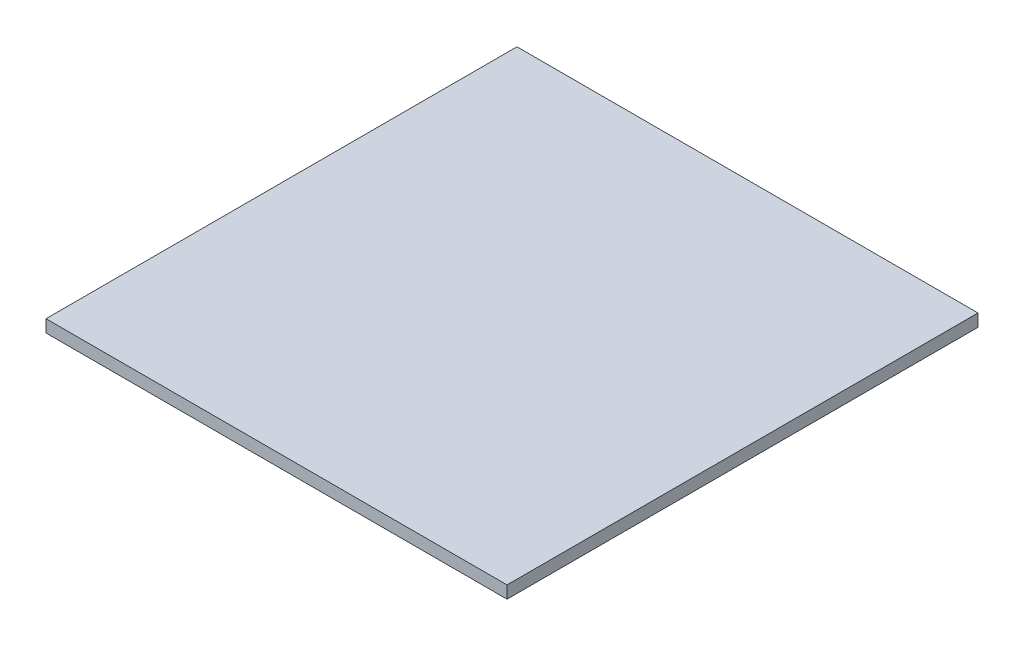
ISO-10303-21;
HEADER;
FILE_DESCRIPTION(('STEP AP214'),'2;1');
FILE_NAME('part.step','',(''),(''),'','','');
FILE_SCHEMA(('AUTOMOTIVE_DESIGN { 1 0 10303 214 1 1 1 1 }'));
ENDSEC;
DATA;
#1=APPLICATION_CONTEXT('core data for automotive mechanical design processes');
#2=APPLICATION_PROTOCOL_DEFINITION('international standard','automotive_design',2000,#1);
#3=PRODUCT_CONTEXT('',#1,'mechanical');
#4=PRODUCT('Part','Part','',(#3));
#5=PRODUCT_RELATED_PRODUCT_CATEGORY('part','',(#4));
#6=PRODUCT_DEFINITION_FORMATION('','',#4);
#7=PRODUCT_DEFINITION_CONTEXT('part definition',#1,'design');
#8=PRODUCT_DEFINITION('design','',#6,#7);
#9=PRODUCT_DEFINITION_SHAPE('','',#8);
#10=(LENGTH_UNIT() NAMED_UNIT(*) SI_UNIT(.MILLI.,.METRE.));
#11=(NAMED_UNIT(*) PLANE_ANGLE_UNIT() SI_UNIT($,.RADIAN.));
#12=(NAMED_UNIT(*) SI_UNIT($,.STERADIAN.) SOLID_ANGLE_UNIT());
#13=UNCERTAINTY_MEASURE_WITH_UNIT(LENGTH_MEASURE(1.E-05),#10,'distance_accuracy_value','');
#14=(GEOMETRIC_REPRESENTATION_CONTEXT(3) GLOBAL_UNCERTAINTY_ASSIGNED_CONTEXT((#13)) GLOBAL_UNIT_ASSIGNED_CONTEXT((#10,
#11,#12)) REPRESENTATION_CONTEXT('',''));
#15=CARTESIAN_POINT('',(0.,0.,0.));
#16=DIRECTION('',(0.,0.,1.));
#17=DIRECTION('',(1.,0.,0.));
#18=AXIS2_PLACEMENT_3D('',#15,#16,#17);
#19=CARTESIAN_POINT('',(0.,15.875,0.));
#20=DIRECTION('',(1.,0.,0.));
#21=DIRECTION('',(0.,0.,-1.));
#22=AXIS2_PLACEMENT_3D('',#19,#20,#21);
#23=PLANE('',#22);
#24=DIRECTION('',(0.,0.,1.));
#25=VECTOR('',#24,1.);
#26=CARTESIAN_POINT('',(0.,0.,0.));
#27=LINE('',#26,#25);
#28=CARTESIAN_POINT('',(0.,0.,-603.25));
#29=VERTEX_POINT('',#28);
#30=CARTESIAN_POINT('',(0.,0.,0.));
#31=VERTEX_POINT('',#30);
#32=EDGE_CURVE('E94',#29,#31,#27,.T.);
#33=ORIENTED_EDGE('',*,*,#32,.T.);
#34=DIRECTION('',(0.,-1.,0.));
#35=VECTOR('',#34,1.);
#36=CARTESIAN_POINT('',(0.,15.875,0.));
#37=LINE('',#36,#35);
#38=CARTESIAN_POINT('',(0.,15.875,0.));
#39=VERTEX_POINT('',#38);
#40=EDGE_CURVE('E11',#39,#31,#37,.T.);
#41=ORIENTED_EDGE('',*,*,#40,.F.);
#42=DIRECTION('',(0.,0.,1.));
#43=VECTOR('',#42,1.);
#44=CARTESIAN_POINT('',(0.,15.875,0.));
#45=LINE('',#44,#43);
#46=CARTESIAN_POINT('',(0.,15.875,-603.25));
#47=VERTEX_POINT('',#46);
#48=EDGE_CURVE('E82',#47,#39,#45,.T.);
#49=ORIENTED_EDGE('',*,*,#48,.F.);
#50=DIRECTION('',(0.,-1.,0.));
#51=VECTOR('',#50,1.);
#52=CARTESIAN_POINT('',(0.,15.875,-603.25));
#53=LINE('',#52,#51);
#54=EDGE_CURVE('E90',#47,#29,#53,.T.);
#55=ORIENTED_EDGE('',*,*,#54,.T.);
#56=EDGE_LOOP('',(#33,#41,#49,#55));
#57=FACE_BOUND('',#56,.T.);
#58=ADVANCED_FACE('F31',(#57),#23,.F.);
#59=CARTESIAN_POINT('',(0.,15.875,0.));
#60=DIRECTION('',(0.,0.,-1.));
#61=DIRECTION('',(-1.,0.,0.));
#62=AXIS2_PLACEMENT_3D('',#59,#60,#61);
#63=PLANE('',#62);
#64=DIRECTION('',(1.,0.,0.));
#65=VECTOR('',#64,1.);
#66=CARTESIAN_POINT('',(0.,0.,0.));
#67=LINE('',#66,#65);
#68=CARTESIAN_POINT('',(590.55,0.,0.));
#69=VERTEX_POINT('',#68);
#70=EDGE_CURVE('E86',#31,#69,#67,.T.);
#71=ORIENTED_EDGE('',*,*,#70,.T.);
#72=DIRECTION('',(0.,-1.,0.));
#73=VECTOR('',#72,1.);
#74=CARTESIAN_POINT('',(590.55,15.875,0.));
#75=LINE('',#74,#73);
#76=CARTESIAN_POINT('',(590.55,15.875,0.));
#77=VERTEX_POINT('',#76);
#78=EDGE_CURVE('E39',#77,#69,#75,.T.);
#79=ORIENTED_EDGE('',*,*,#78,.F.);
#80=DIRECTION('',(1.,0.,0.));
#81=VECTOR('',#80,1.);
#82=CARTESIAN_POINT('',(0.,15.875,0.));
#83=LINE('',#82,#81);
#84=EDGE_CURVE('E77',#39,#77,#83,.T.);
#85=ORIENTED_EDGE('',*,*,#84,.F.);
#86=ORIENTED_EDGE('',*,*,#40,.T.);
#87=EDGE_LOOP('',(#71,#79,#85,#86));
#88=FACE_BOUND('',#87,.T.);
#89=ADVANCED_FACE('F85',(#88),#63,.F.);
#90=CARTESIAN_POINT('',(590.55,15.875,0.));
#91=DIRECTION('',(-1.,0.,0.));
#92=DIRECTION('',(0.,0.,1.));
#93=AXIS2_PLACEMENT_3D('',#90,#91,#92);
#94=PLANE('',#93);
#95=DIRECTION('',(0.,0.,-1.));
#96=VECTOR('',#95,1.);
#97=CARTESIAN_POINT('',(590.55,0.,0.));
#98=LINE('',#97,#96);
#99=CARTESIAN_POINT('',(590.55,0.,-603.25));
#100=VERTEX_POINT('',#99);
#101=EDGE_CURVE('E64',#69,#100,#98,.T.);
#102=ORIENTED_EDGE('',*,*,#101,.T.);
#103=DIRECTION('',(0.,-1.,0.));
#104=VECTOR('',#103,1.);
#105=CARTESIAN_POINT('',(590.55,15.875,-603.25));
#106=LINE('',#105,#104);
#107=CARTESIAN_POINT('',(590.55,15.875,-603.25));
#108=VERTEX_POINT('',#107);
#109=EDGE_CURVE('E87',#108,#100,#106,.T.);
#110=ORIENTED_EDGE('',*,*,#109,.F.);
#111=DIRECTION('',(0.,0.,-1.));
#112=VECTOR('',#111,1.);
#113=CARTESIAN_POINT('',(590.55,15.875,0.));
#114=LINE('',#113,#112);
#115=EDGE_CURVE('E80',#77,#108,#114,.T.);
#116=ORIENTED_EDGE('',*,*,#115,.F.);
#117=ORIENTED_EDGE('',*,*,#78,.T.);
#118=EDGE_LOOP('',(#102,#110,#116,#117));
#119=FACE_BOUND('',#118,.T.);
#120=ADVANCED_FACE('F88',(#119),#94,.F.);
#121=CARTESIAN_POINT('',(0.,15.875,-603.25));
#122=DIRECTION('',(0.,0.,1.));
#123=DIRECTION('',(1.,0.,0.));
#124=AXIS2_PLACEMENT_3D('',#121,#122,#123);
#125=PLANE('',#124);
#126=DIRECTION('',(-1.,0.,0.));
#127=VECTOR('',#126,1.);
#128=CARTESIAN_POINT('',(0.,0.,-603.25));
#129=LINE('',#128,#127);
#130=EDGE_CURVE('E70',#100,#29,#129,.T.);
#131=ORIENTED_EDGE('',*,*,#130,.T.);
#132=ORIENTED_EDGE('',*,*,#54,.F.);
#133=DIRECTION('',(-1.,0.,0.));
#134=VECTOR('',#133,1.);
#135=CARTESIAN_POINT('',(0.,15.875,-603.25));
#136=LINE('',#135,#134);
#137=EDGE_CURVE('E47',#108,#47,#136,.T.);
#138=ORIENTED_EDGE('',*,*,#137,.F.);
#139=ORIENTED_EDGE('',*,*,#109,.T.);
#140=EDGE_LOOP('',(#131,#132,#138,#139));
#141=FACE_BOUND('',#140,.T.);
#142=ADVANCED_FACE('F101',(#141),#125,.F.);
#143=CARTESIAN_POINT('',(0.,15.875,-603.25));
#144=DIRECTION('',(0.,-1.,0.));
#145=DIRECTION('',(0.,0.,-1.));
#146=AXIS2_PLACEMENT_3D('',#143,#144,#145);
#147=PLANE('',#146);
#148=ORIENTED_EDGE('',*,*,#48,.T.);
#149=ORIENTED_EDGE('',*,*,#84,.T.);
#150=ORIENTED_EDGE('',*,*,#115,.T.);
#151=ORIENTED_EDGE('',*,*,#137,.T.);
#152=EDGE_LOOP('',(#148,#149,#150,#151));
#153=FACE_BOUND('',#152,.T.);
#154=ADVANCED_FACE('F78',(#153),#147,.F.);
#155=CARTESIAN_POINT('',(0.,0.,-603.25));
#156=DIRECTION('',(0.,-1.,0.));
#157=DIRECTION('',(0.,0.,-1.));
#158=AXIS2_PLACEMENT_3D('',#155,#156,#157);
#159=PLANE('',#158);
#160=ORIENTED_EDGE('',*,*,#32,.F.);
#161=ORIENTED_EDGE('',*,*,#130,.F.);
#162=ORIENTED_EDGE('',*,*,#101,.F.);
#163=ORIENTED_EDGE('',*,*,#70,.F.);
#164=EDGE_LOOP('',(#160,#161,#162,#163));
#165=FACE_BOUND('',#164,.T.);
#166=ADVANCED_FACE('F104',(#165),#159,.T.);
#167=CLOSED_SHELL('',(#58,#89,#120,#142,#154,#166));
#168=MANIFOLD_SOLID_BREP('B2',#167);
#169=ADVANCED_BREP_SHAPE_REPRESENTATION('',(#18,#168),#14);
#170=SHAPE_DEFINITION_REPRESENTATION(#9,#169);
ENDSEC;
END-ISO-10303-21;
